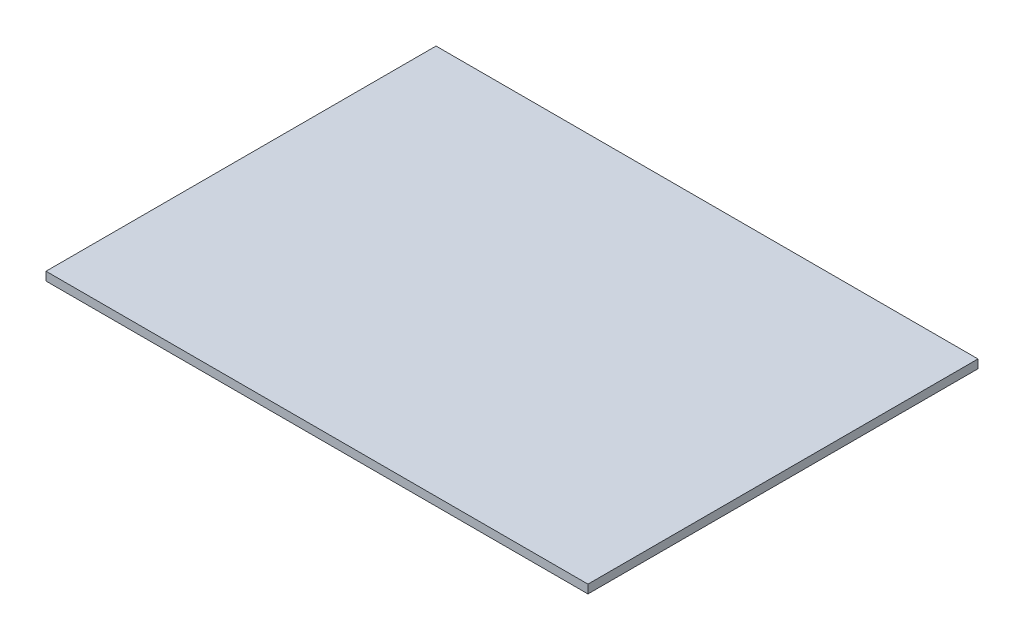
ISO-10303-21;
HEADER;
FILE_DESCRIPTION(('STEP AP214'),'2;1');
FILE_NAME('part.step','',(''),(''),'','','');
FILE_SCHEMA(('AUTOMOTIVE_DESIGN { 1 0 10303 214 1 1 1 1 }'));
ENDSEC;
DATA;
#1=APPLICATION_CONTEXT('core data for automotive mechanical design processes');
#2=APPLICATION_PROTOCOL_DEFINITION('international standard','automotive_design',2000,#1);
#3=PRODUCT_CONTEXT('',#1,'mechanical');
#4=PRODUCT('Part','Part','',(#3));
#5=PRODUCT_RELATED_PRODUCT_CATEGORY('part','',(#4));
#6=PRODUCT_DEFINITION_FORMATION('','',#4);
#7=PRODUCT_DEFINITION_CONTEXT('part definition',#1,'design');
#8=PRODUCT_DEFINITION('design','',#6,#7);
#9=PRODUCT_DEFINITION_SHAPE('','',#8);
#10=(LENGTH_UNIT() NAMED_UNIT(*) SI_UNIT(.MILLI.,.METRE.));
#11=(NAMED_UNIT(*) PLANE_ANGLE_UNIT() SI_UNIT($,.RADIAN.));
#12=(NAMED_UNIT(*) SI_UNIT($,.STERADIAN.) SOLID_ANGLE_UNIT());
#13=UNCERTAINTY_MEASURE_WITH_UNIT(LENGTH_MEASURE(1.E-05),#10,'distance_accuracy_value','');
#14=(GEOMETRIC_REPRESENTATION_CONTEXT(3) GLOBAL_UNCERTAINTY_ASSIGNED_CONTEXT((#13)) GLOBAL_UNIT_ASSIGNED_CONTEXT((#10,
#11,#12)) REPRESENTATION_CONTEXT('',''));
#15=CARTESIAN_POINT('',(0.,0.,0.));
#16=DIRECTION('',(0.,0.,1.));
#17=DIRECTION('',(1.,0.,0.));
#18=AXIS2_PLACEMENT_3D('',#15,#16,#17);
#19=CARTESIAN_POINT('',(-58.7424293485078,1.,-22.0840070963546));
#20=DIRECTION('',(1.,0.,0.));
#21=DIRECTION('',(0.,0.,-1.));
#22=AXIS2_PLACEMENT_3D('',#19,#20,#21);
#23=PLANE('',#22);
#24=DIRECTION('',(0.,0.,1.));
#25=VECTOR('',#24,1.);
#26=CARTESIAN_POINT('',(-58.7424293485078,0.,-22.0840070963546));
#27=LINE('',#26,#25);
#28=CARTESIAN_POINT('',(-58.7424293485078,0.,-22.0840070963546));
#29=VERTEX_POINT('',#28);
#30=CARTESIAN_POINT('',(-58.7424293485078,0.,23.6159929036454));
#31=VERTEX_POINT('',#30);
#32=EDGE_CURVE('E96',#29,#31,#27,.T.);
#33=ORIENTED_EDGE('',*,*,#32,.T.);
#34=DIRECTION('',(0.,-1.,0.));
#35=VECTOR('',#34,1.);
#36=CARTESIAN_POINT('',(-58.7424293485078,1.,23.6159929036454));
#37=LINE('',#36,#35);
#38=CARTESIAN_POINT('',(-58.7424293485078,1.,23.6159929036454));
#39=VERTEX_POINT('',#38);
#40=EDGE_CURVE('E11',#39,#31,#37,.T.);
#41=ORIENTED_EDGE('',*,*,#40,.F.);
#42=DIRECTION('',(0.,0.,1.));
#43=VECTOR('',#42,1.);
#44=CARTESIAN_POINT('',(-58.7424293485078,1.,-22.0840070963546));
#45=LINE('',#44,#43);
#46=CARTESIAN_POINT('',(-58.7424293485078,1.,-22.0840070963546));
#47=VERTEX_POINT('',#46);
#48=EDGE_CURVE('E84',#47,#39,#45,.T.);
#49=ORIENTED_EDGE('',*,*,#48,.F.);
#50=DIRECTION('',(0.,-1.,0.));
#51=VECTOR('',#50,1.);
#52=CARTESIAN_POINT('',(-58.7424293485078,1.,-22.0840070963546));
#53=LINE('',#52,#51);
#54=EDGE_CURVE('E92',#47,#29,#53,.T.);
#55=ORIENTED_EDGE('',*,*,#54,.T.);
#56=EDGE_LOOP('',(#33,#41,#49,#55));
#57=FACE_BOUND('',#56,.T.);
#58=ADVANCED_FACE('F33',(#57),#23,.F.);
#59=CARTESIAN_POINT('',(-58.7424293485078,1.,23.6159929036454));
#60=DIRECTION('',(0.,0.,-1.));
#61=DIRECTION('',(-1.,0.,0.));
#62=AXIS2_PLACEMENT_3D('',#59,#60,#61);
#63=PLANE('',#62);
#64=DIRECTION('',(1.,0.,0.));
#65=VECTOR('',#64,1.);
#66=CARTESIAN_POINT('',(-58.7424293485078,0.,23.6159929036454));
#67=LINE('',#66,#65);
#68=CARTESIAN_POINT('',(4.75757065149224,0.,23.6159929036454));
#69=VERTEX_POINT('',#68);
#70=EDGE_CURVE('E88',#31,#69,#67,.T.);
#71=ORIENTED_EDGE('',*,*,#70,.T.);
#72=DIRECTION('',(0.,-1.,0.));
#73=VECTOR('',#72,1.);
#74=CARTESIAN_POINT('',(4.75757065149224,1.,23.6159929036454));
#75=LINE('',#74,#73);
#76=CARTESIAN_POINT('',(4.75757065149224,1.,23.6159929036454));
#77=VERTEX_POINT('',#76);
#78=EDGE_CURVE('E41',#77,#69,#75,.T.);
#79=ORIENTED_EDGE('',*,*,#78,.F.);
#80=DIRECTION('',(1.,0.,0.));
#81=VECTOR('',#80,1.);
#82=CARTESIAN_POINT('',(-58.7424293485078,1.,23.6159929036454));
#83=LINE('',#82,#81);
#84=EDGE_CURVE('E79',#39,#77,#83,.T.);
#85=ORIENTED_EDGE('',*,*,#84,.F.);
#86=ORIENTED_EDGE('',*,*,#40,.T.);
#87=EDGE_LOOP('',(#71,#79,#85,#86));
#88=FACE_BOUND('',#87,.T.);
#89=ADVANCED_FACE('F87',(#88),#63,.F.);
#90=CARTESIAN_POINT('',(4.75757065149223,1.,-22.0840070963546));
#91=DIRECTION('',(-1.,0.,0.));
#92=DIRECTION('',(0.,0.,1.));
#93=AXIS2_PLACEMENT_3D('',#90,#91,#92);
#94=PLANE('',#93);
#95=DIRECTION('',(0.,0.,-1.));
#96=VECTOR('',#95,1.);
#97=CARTESIAN_POINT('',(4.75757065149223,0.,-22.0840070963546));
#98=LINE('',#97,#96);
#99=CARTESIAN_POINT('',(4.75757065149223,0.,-22.0840070963546));
#100=VERTEX_POINT('',#99);
#101=EDGE_CURVE('E66',#69,#100,#98,.T.);
#102=ORIENTED_EDGE('',*,*,#101,.T.);
#103=DIRECTION('',(0.,-1.,0.));
#104=VECTOR('',#103,1.);
#105=CARTESIAN_POINT('',(4.75757065149223,1.,-22.0840070963546));
#106=LINE('',#105,#104);
#107=CARTESIAN_POINT('',(4.75757065149223,1.,-22.0840070963546));
#108=VERTEX_POINT('',#107);
#109=EDGE_CURVE('E89',#108,#100,#106,.T.);
#110=ORIENTED_EDGE('',*,*,#109,.F.);
#111=DIRECTION('',(0.,0.,-1.));
#112=VECTOR('',#111,1.);
#113=CARTESIAN_POINT('',(4.75757065149223,1.,-22.0840070963546));
#114=LINE('',#113,#112);
#115=EDGE_CURVE('E82',#77,#108,#114,.T.);
#116=ORIENTED_EDGE('',*,*,#115,.F.);
#117=ORIENTED_EDGE('',*,*,#78,.T.);
#118=EDGE_LOOP('',(#102,#110,#116,#117));
#119=FACE_BOUND('',#118,.T.);
#120=ADVANCED_FACE('F90',(#119),#94,.F.);
#121=CARTESIAN_POINT('',(-58.7424293485078,1.,-22.0840070963546));
#122=DIRECTION('',(0.,0.,1.));
#123=DIRECTION('',(1.,0.,0.));
#124=AXIS2_PLACEMENT_3D('',#121,#122,#123);
#125=PLANE('',#124);
#126=DIRECTION('',(-1.,0.,0.));
#127=VECTOR('',#126,1.);
#128=CARTESIAN_POINT('',(-58.7424293485078,0.,-22.0840070963546));
#129=LINE('',#128,#127);
#130=EDGE_CURVE('E72',#100,#29,#129,.T.);
#131=ORIENTED_EDGE('',*,*,#130,.T.);
#132=ORIENTED_EDGE('',*,*,#54,.F.);
#133=DIRECTION('',(-1.,0.,0.));
#134=VECTOR('',#133,1.);
#135=CARTESIAN_POINT('',(-58.7424293485078,1.,-22.0840070963546));
#136=LINE('',#135,#134);
#137=EDGE_CURVE('E49',#108,#47,#136,.T.);
#138=ORIENTED_EDGE('',*,*,#137,.F.);
#139=ORIENTED_EDGE('',*,*,#109,.T.);
#140=EDGE_LOOP('',(#131,#132,#138,#139));
#141=FACE_BOUND('',#140,.T.);
#142=ADVANCED_FACE('F103',(#141),#125,.F.);
#143=CARTESIAN_POINT('',(0.,1.,0.));
#144=DIRECTION('',(0.,1.,0.));
#145=DIRECTION('',(0.,0.,1.));
#146=AXIS2_PLACEMENT_3D('',#143,#144,#145);
#147=PLANE('',#146);
#148=ORIENTED_EDGE('',*,*,#48,.T.);
#149=ORIENTED_EDGE('',*,*,#84,.T.);
#150=ORIENTED_EDGE('',*,*,#115,.T.);
#151=ORIENTED_EDGE('',*,*,#137,.T.);
#152=EDGE_LOOP('',(#148,#149,#150,#151));
#153=FACE_BOUND('',#152,.T.);
#154=ADVANCED_FACE('F80',(#153),#147,.T.);
#155=CARTESIAN_POINT('',(0.,0.,0.));
#156=DIRECTION('',(0.,1.,0.));
#157=DIRECTION('',(0.,0.,1.));
#158=AXIS2_PLACEMENT_3D('',#155,#156,#157);
#159=PLANE('',#158);
#160=ORIENTED_EDGE('',*,*,#32,.F.);
#161=ORIENTED_EDGE('',*,*,#130,.F.);
#162=ORIENTED_EDGE('',*,*,#101,.F.);
#163=ORIENTED_EDGE('',*,*,#70,.F.);
#164=EDGE_LOOP('',(#160,#161,#162,#163));
#165=FACE_BOUND('',#164,.T.);
#166=ADVANCED_FACE('F106',(#165),#159,.F.);
#167=CLOSED_SHELL('',(#58,#89,#120,#142,#154,#166));
#168=MANIFOLD_SOLID_BREP('B2',#167);
#169=ADVANCED_BREP_SHAPE_REPRESENTATION('',(#18,#168),#14);
#170=SHAPE_DEFINITION_REPRESENTATION(#9,#169);
ENDSEC;
END-ISO-10303-21;
